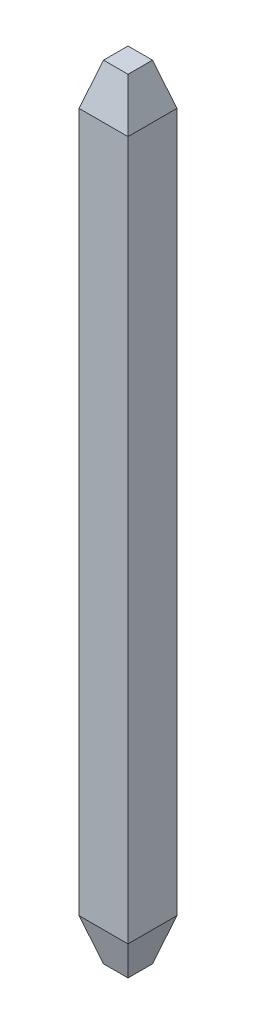
ISO-10303-21;
HEADER;
FILE_DESCRIPTION(('STEP AP214'),'2;1');
FILE_NAME('part.step','',(''),(''),'','','');
FILE_SCHEMA(('AUTOMOTIVE_DESIGN { 1 0 10303 214 1 1 1 1 }'));
ENDSEC;
DATA;
#1=APPLICATION_CONTEXT('core data for automotive mechanical design processes');
#2=APPLICATION_PROTOCOL_DEFINITION('international standard','automotive_design',2000,#1);
#3=PRODUCT_CONTEXT('',#1,'mechanical');
#4=PRODUCT('Part','Part','',(#3));
#5=PRODUCT_RELATED_PRODUCT_CATEGORY('part','',(#4));
#6=PRODUCT_DEFINITION_FORMATION('','',#4);
#7=PRODUCT_DEFINITION_CONTEXT('part definition',#1,'design');
#8=PRODUCT_DEFINITION('design','',#6,#7);
#9=PRODUCT_DEFINITION_SHAPE('','',#8);
#10=(LENGTH_UNIT() NAMED_UNIT(*) SI_UNIT(.MILLI.,.METRE.));
#11=(NAMED_UNIT(*) PLANE_ANGLE_UNIT() SI_UNIT($,.RADIAN.));
#12=(NAMED_UNIT(*) SI_UNIT($,.STERADIAN.) SOLID_ANGLE_UNIT());
#13=UNCERTAINTY_MEASURE_WITH_UNIT(LENGTH_MEASURE(1.E-05),#10,'distance_accuracy_value','');
#14=(GEOMETRIC_REPRESENTATION_CONTEXT(3) GLOBAL_UNCERTAINTY_ASSIGNED_CONTEXT((#13)) GLOBAL_UNIT_ASSIGNED_CONTEXT((#10,
#11,#12)) REPRESENTATION_CONTEXT('',''));
#15=CARTESIAN_POINT('',(0.,0.,0.));
#16=DIRECTION('',(0.,0.,1.));
#17=DIRECTION('',(1.,0.,0.));
#18=AXIS2_PLACEMENT_3D('',#15,#16,#17);
#19=CARTESIAN_POINT('',(-26.189999999987,-0.965870106912753,-19.5199999999763));
#20=DIRECTION('',(0.959644900900968,0.281214622974644,0.));
#21=DIRECTION('',(0.,0.,-1.));
#22=AXIS2_PLACEMENT_3D('',#19,#20,#21);
#23=PLANE('',#22);
#24=DIRECTION('',(-0.270714017147727,0.923811583516617,0.270714017147727));
#25=VECTOR('',#24,1.);
#26=CARTESIAN_POINT('',(-26.189999999987,-0.965870106912753,-19.8399999999763));
#27=LINE('',#26,#25);
#28=CARTESIAN_POINT('',(-26.189999999987,-0.965870106912755,-19.8399999999763));
#29=VERTEX_POINT('',#28);
#30=CARTESIAN_POINT('',(-26.349999999987,-0.419870106912756,-19.6799999999763));
#31=VERTEX_POINT('',#30);
#32=EDGE_CURVE('E11',#29,#31,#27,.T.);
#33=ORIENTED_EDGE('',*,*,#32,.T.);
#34=DIRECTION('',(0.,0.,1.));
#35=VECTOR('',#34,1.);
#36=CARTESIAN_POINT('',(-26.349999999987,-0.419870106912754,-19.6799999999763));
#37=LINE('',#36,#35);
#38=CARTESIAN_POINT('',(-26.349999999987,-0.419870106912756,-19.3599999999763));
#39=VERTEX_POINT('',#38);
#40=EDGE_CURVE('E28',#31,#39,#37,.T.);
#41=ORIENTED_EDGE('',*,*,#40,.T.);
#42=DIRECTION('',(-0.270714017147727,0.923811583516617,-0.270714017147727));
#43=VECTOR('',#42,1.);
#44=CARTESIAN_POINT('',(-26.189999999987,-0.965870106912753,-19.1999999999763));
#45=LINE('',#44,#43);
#46=CARTESIAN_POINT('',(-26.189999999987,-0.965870106912755,-19.1999999999763));
#47=VERTEX_POINT('',#46);
#48=EDGE_CURVE('E178',#47,#39,#45,.T.);
#49=ORIENTED_EDGE('',*,*,#48,.F.);
#50=DIRECTION('',(0.,0.,1.));
#51=VECTOR('',#50,1.);
#52=CARTESIAN_POINT('',(-26.189999999987,-0.965870106912753,-19.8399999999763));
#53=LINE('',#52,#51);
#54=EDGE_CURVE('E170',#29,#47,#53,.T.);
#55=ORIENTED_EDGE('',*,*,#54,.F.);
#56=EDGE_LOOP('',(#33,#41,#49,#55));
#57=FACE_BOUND('',#56,.T.);
#58=ADVANCED_FACE('F17',(#57),#23,.T.);
#59=CARTESIAN_POINT('',(-26.509999999987,-0.965870106912753,-19.8399999999763));
#60=DIRECTION('',(0.,0.281214622974644,-0.959644900900968));
#61=DIRECTION('',(-1.,0.,0.));
#62=AXIS2_PLACEMENT_3D('',#59,#60,#61);
#63=PLANE('',#62);
#64=DIRECTION('',(0.270714017147727,0.923811583516617,0.270714017147727));
#65=VECTOR('',#64,1.);
#66=CARTESIAN_POINT('',(-26.829999999987,-0.965870106912753,-19.8399999999763));
#67=LINE('',#66,#65);
#68=CARTESIAN_POINT('',(-26.829999999987,-0.965870106912755,-19.8399999999763));
#69=VERTEX_POINT('',#68);
#70=CARTESIAN_POINT('',(-26.669999999987,-0.419870106912756,-19.6799999999763));
#71=VERTEX_POINT('',#70);
#72=EDGE_CURVE('E191',#69,#71,#67,.T.);
#73=ORIENTED_EDGE('',*,*,#72,.T.);
#74=DIRECTION('',(1.,0.,0.));
#75=VECTOR('',#74,1.);
#76=CARTESIAN_POINT('',(-26.669999999987,-0.419870106912754,-19.6799999999763));
#77=LINE('',#76,#75);
#78=EDGE_CURVE('E187',#71,#31,#77,.T.);
#79=ORIENTED_EDGE('',*,*,#78,.T.);
#80=ORIENTED_EDGE('',*,*,#32,.F.);
#81=DIRECTION('',(1.,0.,0.));
#82=VECTOR('',#81,1.);
#83=CARTESIAN_POINT('',(-26.829999999987,-0.965870106912753,-19.8399999999763));
#84=LINE('',#83,#82);
#85=EDGE_CURVE('E167',#69,#29,#84,.T.);
#86=ORIENTED_EDGE('',*,*,#85,.F.);
#87=EDGE_LOOP('',(#73,#79,#80,#86));
#88=FACE_BOUND('',#87,.T.);
#89=ADVANCED_FACE('F413',(#88),#63,.T.);
#90=CARTESIAN_POINT('',(-26.829999999987,-0.965870106912753,-19.5199999999763));
#91=DIRECTION('',(-0.959644900900968,0.281214622974644,0.));
#92=DIRECTION('',(0.,0.,1.));
#93=AXIS2_PLACEMENT_3D('',#90,#91,#92);
#94=PLANE('',#93);
#95=DIRECTION('',(0.270714017147727,0.923811583516617,-0.270714017147727));
#96=VECTOR('',#95,1.);
#97=CARTESIAN_POINT('',(-26.829999999987,-0.965870106912753,-19.1999999999763));
#98=LINE('',#97,#96);
#99=CARTESIAN_POINT('',(-26.829999999987,-0.965870106912755,-19.1999999999763));
#100=VERTEX_POINT('',#99);
#101=CARTESIAN_POINT('',(-26.669999999987,-0.419870106912756,-19.3599999999763));
#102=VERTEX_POINT('',#101);
#103=EDGE_CURVE('E192',#100,#102,#98,.T.);
#104=ORIENTED_EDGE('',*,*,#103,.T.);
#105=DIRECTION('',(0.,0.,-1.));
#106=VECTOR('',#105,1.);
#107=CARTESIAN_POINT('',(-26.669999999987,-0.419870106912754,-19.3599999999763));
#108=LINE('',#107,#106);
#109=EDGE_CURVE('E205',#102,#71,#108,.T.);
#110=ORIENTED_EDGE('',*,*,#109,.T.);
#111=ORIENTED_EDGE('',*,*,#72,.F.);
#112=DIRECTION('',(0.,0.,-1.));
#113=VECTOR('',#112,1.);
#114=CARTESIAN_POINT('',(-26.829999999987,-0.965870106912753,-19.1999999999763));
#115=LINE('',#114,#113);
#116=EDGE_CURVE('E204',#100,#69,#115,.T.);
#117=ORIENTED_EDGE('',*,*,#116,.F.);
#118=EDGE_LOOP('',(#104,#110,#111,#117));
#119=FACE_BOUND('',#118,.T.);
#120=ADVANCED_FACE('F231',(#119),#94,.T.);
#121=CARTESIAN_POINT('',(-26.829999999987,-5.53543505344803,-19.1989999999763));
#122=DIRECTION('',(-1.,0.,0.));
#123=DIRECTION('',(0.,0.,1.));
#124=AXIS2_PLACEMENT_3D('',#121,#122,#123);
#125=PLANE('',#124);
#126=DIRECTION('',(0.,1.,0.));
#127=VECTOR('',#126,1.);
#128=CARTESIAN_POINT('',(-26.829999999987,-10.1039999999833,-19.8399999999763));
#129=LINE('',#128,#127);
#130=CARTESIAN_POINT('',(-26.829999999987,-10.1039999999833,-19.8399999999763));
#131=VERTEX_POINT('',#130);
#132=EDGE_CURVE('E176',#131,#69,#129,.T.);
#133=ORIENTED_EDGE('',*,*,#132,.F.);
#134=DIRECTION('',(0.,0.,-1.));
#135=VECTOR('',#134,1.);
#136=CARTESIAN_POINT('',(-26.829999999987,-10.1039999999833,-19.1999999999763));
#137=LINE('',#136,#135);
#138=CARTESIAN_POINT('',(-26.829999999987,-10.1039999999833,-19.1999999999763));
#139=VERTEX_POINT('',#138);
#140=EDGE_CURVE('E133',#139,#131,#137,.T.);
#141=ORIENTED_EDGE('',*,*,#140,.F.);
#142=DIRECTION('',(0.,1.,0.));
#143=VECTOR('',#142,1.);
#144=CARTESIAN_POINT('',(-26.829999999987,-10.1039999999833,-19.1999999999763));
#145=LINE('',#144,#143);
#146=EDGE_CURVE('E21',#139,#100,#145,.T.);
#147=ORIENTED_EDGE('',*,*,#146,.T.);
#148=ORIENTED_EDGE('',*,*,#116,.T.);
#149=EDGE_LOOP('',(#133,#141,#147,#148));
#150=FACE_BOUND('',#149,.T.);
#151=ADVANCED_FACE('F236',(#150),#125,.T.);
#152=CARTESIAN_POINT('',(-26.830999999987,-5.53543505344803,-19.1999999999763));
#153=DIRECTION('',(0.,0.,1.));
#154=DIRECTION('',(1.,0.,0.));
#155=AXIS2_PLACEMENT_3D('',#152,#153,#154);
#156=PLANE('',#155);
#157=ORIENTED_EDGE('',*,*,#146,.F.);
#158=DIRECTION('',(-1.,0.,0.));
#159=VECTOR('',#158,1.);
#160=CARTESIAN_POINT('',(-26.189999999987,-10.1039999999833,-19.1999999999763));
#161=LINE('',#160,#159);
#162=CARTESIAN_POINT('',(-26.189999999987,-10.1039999999833,-19.1999999999763));
#163=VERTEX_POINT('',#162);
#164=EDGE_CURVE('E115',#163,#139,#161,.T.);
#165=ORIENTED_EDGE('',*,*,#164,.F.);
#166=DIRECTION('',(0.,1.,0.));
#167=VECTOR('',#166,1.);
#168=CARTESIAN_POINT('',(-26.189999999987,-10.1039999999833,-19.1999999999763));
#169=LINE('',#168,#167);
#170=EDGE_CURVE('E144',#163,#47,#169,.T.);
#171=ORIENTED_EDGE('',*,*,#170,.T.);
#172=DIRECTION('',(-1.,0.,0.));
#173=VECTOR('',#172,1.);
#174=CARTESIAN_POINT('',(-26.189999999987,-0.965870106912753,-19.1999999999763));
#175=LINE('',#174,#173);
#176=EDGE_CURVE('E141',#47,#100,#175,.T.);
#177=ORIENTED_EDGE('',*,*,#176,.T.);
#178=EDGE_LOOP('',(#157,#165,#171,#177));
#179=FACE_BOUND('',#178,.T.);
#180=ADVANCED_FACE('F220',(#179),#156,.T.);
#181=CARTESIAN_POINT('',(-26.509999999987,-10.1039999999833,-19.1999999999763));
#182=DIRECTION('',(0.,-0.281214622974642,0.959644900900969));
#183=DIRECTION('',(-1.,0.,0.));
#184=AXIS2_PLACEMENT_3D('',#181,#182,#183);
#185=PLANE('',#184);
#186=ORIENTED_EDGE('',*,*,#164,.T.);
#187=DIRECTION('',(0.270714017147726,-0.923811583516618,-0.270714017147726));
#188=VECTOR('',#187,1.);
#189=CARTESIAN_POINT('',(-26.829999999987,-10.1039999999833,-19.1999999999763));
#190=LINE('',#189,#188);
#191=CARTESIAN_POINT('',(-26.669999999987,-10.6499999999833,-19.3599999999763));
#192=VERTEX_POINT('',#191);
#193=EDGE_CURVE('E112',#139,#192,#190,.T.);
#194=ORIENTED_EDGE('',*,*,#193,.T.);
#195=DIRECTION('',(-1.,0.,0.));
#196=VECTOR('',#195,1.);
#197=CARTESIAN_POINT('',(-26.349999999987,-10.6499999999833,-19.3599999999763));
#198=LINE('',#197,#196);
#199=CARTESIAN_POINT('',(-26.349999999987,-10.6499999999833,-19.3599999999763));
#200=VERTEX_POINT('',#199);
#201=EDGE_CURVE('E99',#200,#192,#198,.T.);
#202=ORIENTED_EDGE('',*,*,#201,.F.);
#203=DIRECTION('',(-0.270714017147726,-0.923811583516618,-0.270714017147726));
#204=VECTOR('',#203,1.);
#205=CARTESIAN_POINT('',(-26.189999999987,-10.1039999999833,-19.1999999999763));
#206=LINE('',#205,#204);
#207=EDGE_CURVE('E137',#163,#200,#206,.T.);
#208=ORIENTED_EDGE('',*,*,#207,.F.);
#209=EDGE_LOOP('',(#186,#194,#202,#208));
#210=FACE_BOUND('',#209,.T.);
#211=ADVANCED_FACE('F113',(#210),#185,.T.);
#212=CARTESIAN_POINT('',(-26.189999999987,-10.1039999999833,-19.5199999999763));
#213=DIRECTION('',(0.959644900900969,-0.281214622974642,0.));
#214=DIRECTION('',(0.,0.,-1.));
#215=AXIS2_PLACEMENT_3D('',#212,#213,#214);
#216=PLANE('',#215);
#217=DIRECTION('',(0.,0.,1.));
#218=VECTOR('',#217,1.);
#219=CARTESIAN_POINT('',(-26.189999999987,-10.1039999999833,-19.8399999999763));
#220=LINE('',#219,#218);
#221=CARTESIAN_POINT('',(-26.189999999987,-10.1039999999833,-19.8399999999763));
#222=VERTEX_POINT('',#221);
#223=EDGE_CURVE('E120',#222,#163,#220,.T.);
#224=ORIENTED_EDGE('',*,*,#223,.T.);
#225=ORIENTED_EDGE('',*,*,#207,.T.);
#226=DIRECTION('',(0.,0.,1.));
#227=VECTOR('',#226,1.);
#228=CARTESIAN_POINT('',(-26.349999999987,-10.6499999999833,-19.6799999999763));
#229=LINE('',#228,#227);
#230=CARTESIAN_POINT('',(-26.349999999987,-10.6499999999833,-19.6799999999763));
#231=VERTEX_POINT('',#230);
#232=EDGE_CURVE('E105',#231,#200,#229,.T.);
#233=ORIENTED_EDGE('',*,*,#232,.F.);
#234=DIRECTION('',(-0.270714017147726,-0.923811583516618,0.270714017147726));
#235=VECTOR('',#234,1.);
#236=CARTESIAN_POINT('',(-26.189999999987,-10.1039999999833,-19.8399999999763));
#237=LINE('',#236,#235);
#238=EDGE_CURVE('E153',#222,#231,#237,.T.);
#239=ORIENTED_EDGE('',*,*,#238,.F.);
#240=EDGE_LOOP('',(#224,#225,#233,#239));
#241=FACE_BOUND('',#240,.T.);
#242=ADVANCED_FACE('F151',(#241),#216,.T.);
#243=CARTESIAN_POINT('',(-26.509999999987,-10.1039999999833,-19.8399999999763));
#244=DIRECTION('',(0.,-0.281214622974642,-0.959644900900969));
#245=DIRECTION('',(0.,-0.959644900900969,0.281214622974642));
#246=AXIS2_PLACEMENT_3D('',#243,#244,#245);
#247=PLANE('',#246);
#248=DIRECTION('',(1.,0.,0.));
#249=VECTOR('',#248,1.);
#250=CARTESIAN_POINT('',(-26.829999999987,-10.1039999999833,-19.8399999999763));
#251=LINE('',#250,#249);
#252=EDGE_CURVE('E140',#131,#222,#251,.T.);
#253=ORIENTED_EDGE('',*,*,#252,.T.);
#254=ORIENTED_EDGE('',*,*,#238,.T.);
#255=DIRECTION('',(1.,0.,0.));
#256=VECTOR('',#255,1.);
#257=CARTESIAN_POINT('',(-26.669999999987,-10.6499999999833,-19.6799999999763));
#258=LINE('',#257,#256);
#259=CARTESIAN_POINT('',(-26.669999999987,-10.6499999999833,-19.6799999999763));
#260=VERTEX_POINT('',#259);
#261=EDGE_CURVE('E127',#260,#231,#258,.T.);
#262=ORIENTED_EDGE('',*,*,#261,.F.);
#263=DIRECTION('',(0.270714017147726,-0.923811583516618,0.270714017147726));
#264=VECTOR('',#263,1.);
#265=CARTESIAN_POINT('',(-26.829999999987,-10.1039999999833,-19.8399999999763));
#266=LINE('',#265,#264);
#267=EDGE_CURVE('E124',#131,#260,#266,.T.);
#268=ORIENTED_EDGE('',*,*,#267,.F.);
#269=EDGE_LOOP('',(#253,#254,#262,#268));
#270=FACE_BOUND('',#269,.T.);
#271=ADVANCED_FACE('F367',(#270),#247,.T.);
#272=CARTESIAN_POINT('',(-26.670999999987,-10.6499999999833,-19.5199999999763));
#273=DIRECTION('',(0.,-1.,0.));
#274=DIRECTION('',(0.,0.,-1.));
#275=AXIS2_PLACEMENT_3D('',#272,#273,#274);
#276=PLANE('',#275);
#277=ORIENTED_EDGE('',*,*,#232,.T.);
#278=ORIENTED_EDGE('',*,*,#201,.T.);
#279=DIRECTION('',(0.,0.,-1.));
#280=VECTOR('',#279,1.);
#281=CARTESIAN_POINT('',(-26.669999999987,-10.6499999999833,-19.3599999999763));
#282=LINE('',#281,#280);
#283=EDGE_CURVE('E104',#192,#260,#282,.T.);
#284=ORIENTED_EDGE('',*,*,#283,.T.);
#285=ORIENTED_EDGE('',*,*,#261,.T.);
#286=EDGE_LOOP('',(#277,#278,#284,#285));
#287=FACE_BOUND('',#286,.T.);
#288=ADVANCED_FACE('F101',(#287),#276,.T.);
#289=CARTESIAN_POINT('',(-26.829999999987,-10.1039999999833,-19.5199999999763));
#290=DIRECTION('',(-0.959644900900969,-0.281214622974642,0.));
#291=DIRECTION('',(-0.281214622974642,0.959644900900969,0.));
#292=AXIS2_PLACEMENT_3D('',#289,#290,#291);
#293=PLANE('',#292);
#294=ORIENTED_EDGE('',*,*,#140,.T.);
#295=ORIENTED_EDGE('',*,*,#267,.T.);
#296=ORIENTED_EDGE('',*,*,#283,.F.);
#297=ORIENTED_EDGE('',*,*,#193,.F.);
#298=EDGE_LOOP('',(#294,#295,#296,#297));
#299=FACE_BOUND('',#298,.T.);
#300=ADVANCED_FACE('F122',(#299),#293,.T.);
#301=CARTESIAN_POINT('',(-26.188999999987,-5.53443505344803,-19.8399999999763));
#302=DIRECTION('',(0.,0.,-1.));
#303=DIRECTION('',(0.,-1.,0.));
#304=AXIS2_PLACEMENT_3D('',#301,#302,#303);
#305=PLANE('',#304);
#306=DIRECTION('',(0.,1.,0.));
#307=VECTOR('',#306,1.);
#308=CARTESIAN_POINT('',(-26.189999999987,-10.1039999999833,-19.8399999999763));
#309=LINE('',#308,#307);
#310=EDGE_CURVE('E160',#222,#29,#309,.T.);
#311=ORIENTED_EDGE('',*,*,#310,.F.);
#312=ORIENTED_EDGE('',*,*,#252,.F.);
#313=ORIENTED_EDGE('',*,*,#132,.T.);
#314=ORIENTED_EDGE('',*,*,#85,.T.);
#315=EDGE_LOOP('',(#311,#312,#313,#314));
#316=FACE_BOUND('',#315,.T.);
#317=ADVANCED_FACE('F165',(#316),#305,.T.);
#318=CARTESIAN_POINT('',(-26.189999999987,-11.0738701069128,-19.5199999999763));
#319=DIRECTION('',(1.,0.,0.));
#320=DIRECTION('',(0.,1.,0.));
#321=AXIS2_PLACEMENT_3D('',#318,#319,#320);
#322=PLANE('',#321);
#323=ORIENTED_EDGE('',*,*,#170,.F.);
#324=ORIENTED_EDGE('',*,*,#223,.F.);
#325=ORIENTED_EDGE('',*,*,#310,.T.);
#326=ORIENTED_EDGE('',*,*,#54,.T.);
#327=EDGE_LOOP('',(#323,#324,#325,#326));
#328=FACE_BOUND('',#327,.T.);
#329=ADVANCED_FACE('F19',(#328),#322,.T.);
#330=CARTESIAN_POINT('',(-26.509999999987,-0.965870106912753,-19.1999999999763));
#331=DIRECTION('',(0.,0.281214622974644,0.959644900900968));
#332=DIRECTION('',(1.,0.,0.));
#333=AXIS2_PLACEMENT_3D('',#330,#331,#332);
#334=PLANE('',#333);
#335=ORIENTED_EDGE('',*,*,#48,.T.);
#336=DIRECTION('',(-1.,0.,0.));
#337=VECTOR('',#336,1.);
#338=CARTESIAN_POINT('',(-26.349999999987,-0.419870106912754,-19.3599999999763));
#339=LINE('',#338,#337);
#340=EDGE_CURVE('E195',#39,#102,#339,.T.);
#341=ORIENTED_EDGE('',*,*,#340,.T.);
#342=ORIENTED_EDGE('',*,*,#103,.F.);
#343=ORIENTED_EDGE('',*,*,#176,.F.);
#344=EDGE_LOOP('',(#335,#341,#342,#343));
#345=FACE_BOUND('',#344,.T.);
#346=ADVANCED_FACE('F217',(#345),#334,.T.);
#347=CARTESIAN_POINT('',(-26.509999999987,-0.419870106912754,-19.6809999999763));
#348=DIRECTION('',(0.,1.,0.));
#349=DIRECTION('',(1.,0.,0.));
#350=AXIS2_PLACEMENT_3D('',#347,#348,#349);
#351=PLANE('',#350);
#352=ORIENTED_EDGE('',*,*,#78,.F.);
#353=ORIENTED_EDGE('',*,*,#109,.F.);
#354=ORIENTED_EDGE('',*,*,#340,.F.);
#355=ORIENTED_EDGE('',*,*,#40,.F.);
#356=EDGE_LOOP('',(#352,#353,#354,#355));
#357=FACE_BOUND('',#356,.T.);
#358=ADVANCED_FACE('F213',(#357),#351,.T.);
#359=CLOSED_SHELL('',(#58,#89,#120,#151,#180,#211,#242,#271,#288,#300,#317,#329,#346,#358));
#360=MANIFOLD_SOLID_BREP('B1',#359);
#361=ADVANCED_BREP_SHAPE_REPRESENTATION('',(#18,#360),#14);
#362=SHAPE_DEFINITION_REPRESENTATION(#9,#361);
ENDSEC;
END-ISO-10303-21;
